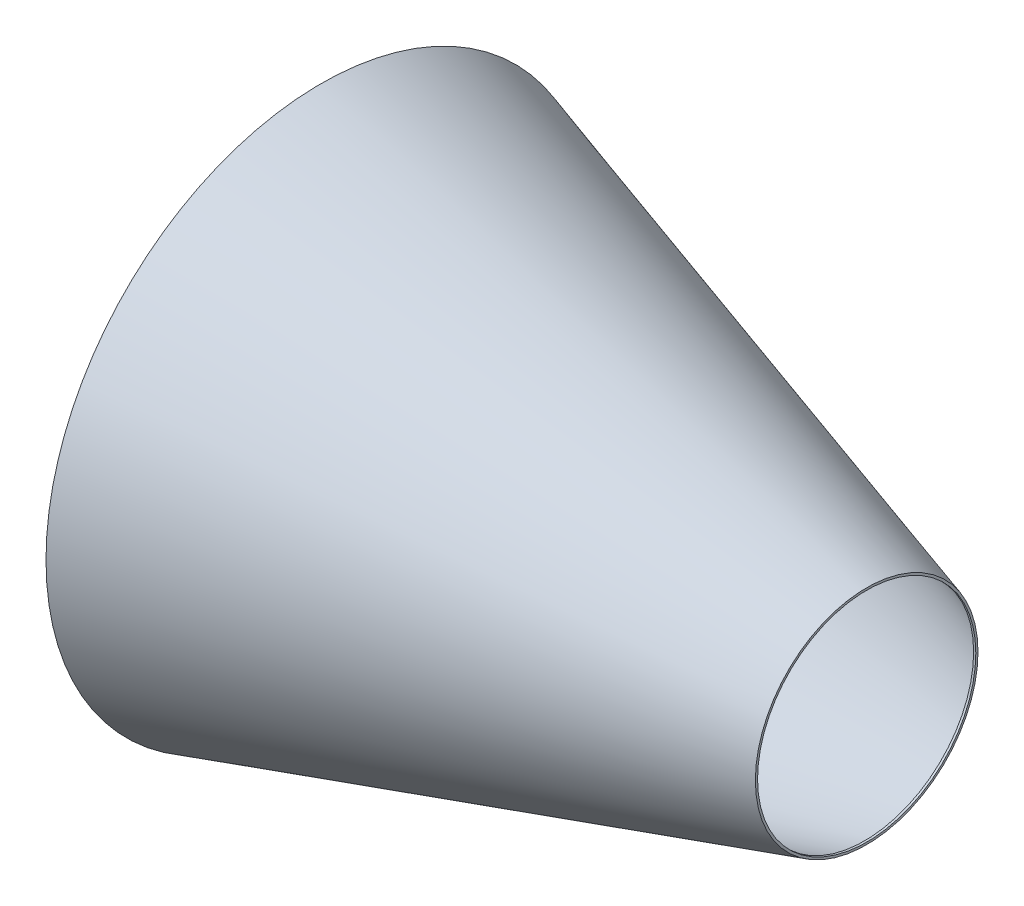
ISO-10303-21;
HEADER;
FILE_DESCRIPTION(('STEP AP214'),'2;1');
FILE_NAME('part.step','',(''),(''),'','','');
FILE_SCHEMA(('AUTOMOTIVE_DESIGN { 1 0 10303 214 1 1 1 1 }'));
ENDSEC;
DATA;
#1=APPLICATION_CONTEXT('core data for automotive mechanical design processes');
#2=APPLICATION_PROTOCOL_DEFINITION('international standard','automotive_design',2000,#1);
#3=PRODUCT_CONTEXT('',#1,'mechanical');
#4=PRODUCT('Part','Part','',(#3));
#5=PRODUCT_RELATED_PRODUCT_CATEGORY('part','',(#4));
#6=PRODUCT_DEFINITION_FORMATION('','',#4);
#7=PRODUCT_DEFINITION_CONTEXT('part definition',#1,'design');
#8=PRODUCT_DEFINITION('design','',#6,#7);
#9=PRODUCT_DEFINITION_SHAPE('','',#8);
#10=(LENGTH_UNIT() NAMED_UNIT(*) SI_UNIT(.MILLI.,.METRE.));
#11=(NAMED_UNIT(*) PLANE_ANGLE_UNIT() SI_UNIT($,.RADIAN.));
#12=(NAMED_UNIT(*) SI_UNIT($,.STERADIAN.) SOLID_ANGLE_UNIT());
#13=UNCERTAINTY_MEASURE_WITH_UNIT(LENGTH_MEASURE(1.E-05),#10,'distance_accuracy_value','');
#14=(GEOMETRIC_REPRESENTATION_CONTEXT(3) GLOBAL_UNCERTAINTY_ASSIGNED_CONTEXT((#13)) GLOBAL_UNIT_ASSIGNED_CONTEXT((#10,
#11,#12)) REPRESENTATION_CONTEXT('',''));
#15=CARTESIAN_POINT('',(0.,0.,0.));
#16=DIRECTION('',(0.,0.,1.));
#17=DIRECTION('',(1.,0.,0.));
#18=AXIS2_PLACEMENT_3D('',#15,#16,#17);
#19=CARTESIAN_POINT('',(2.,0.,0.));
#20=DIRECTION('',(-1.,0.,0.));
#21=DIRECTION('',(0.,0.,1.));
#22=AXIS2_PLACEMENT_3D('',#19,#20,#21);
#23=CONICAL_SURFACE('',#22,249.311938698218,0.291456794477867);
#24=CARTESIAN_POINT('',(498.,0.,0.));
#25=DIRECTION('',(-1.,0.,0.));
#26=DIRECTION('',(0.,0.,1.));
#27=AXIS2_PLACEMENT_3D('',#24,#25,#26);
#28=CIRCLE('',#27,100.511938698218);
#29=CARTESIAN_POINT('',(498.,0.,100.511938698218));
#30=VERTEX_POINT('',#29);
#31=EDGE_CURVE('E10',#30,#30,#28,.T.);
#32=ORIENTED_EDGE('',*,*,#31,.F.);
#33=EDGE_LOOP('',(#32));
#34=FACE_BOUND('',#33,.T.);
#35=CARTESIAN_POINT('',(2.,0.,0.));
#36=DIRECTION('',(-1.,0.,0.));
#37=DIRECTION('',(0.,0.,1.));
#38=AXIS2_PLACEMENT_3D('',#35,#36,#37);
#39=CIRCLE('',#38,249.311938698218);
#40=CARTESIAN_POINT('',(2.,0.,249.311938698218));
#41=VERTEX_POINT('',#40);
#42=EDGE_CURVE('E44',#41,#41,#39,.T.);
#43=ORIENTED_EDGE('',*,*,#42,.T.);
#44=EDGE_LOOP('',(#43));
#45=FACE_BOUND('',#44,.T.);
#46=ADVANCED_FACE('F41',(#34,#45),#23,.F.);
#47=CARTESIAN_POINT('',(498.,-2.,0.));
#48=DIRECTION('',(1.,0.,0.));
#49=DIRECTION('',(0.,0.,-1.));
#50=AXIS2_PLACEMENT_3D('',#47,#48,#49);
#51=PLANE('',#50);
#52=CARTESIAN_POINT('',(498.,0.,0.));
#53=DIRECTION('',(1.,0.,0.));
#54=DIRECTION('',(0.,0.,-1.));
#55=AXIS2_PLACEMENT_3D('',#52,#53,#54);
#56=CIRCLE('',#55,100.);
#57=CARTESIAN_POINT('',(498.,0.,-100.));
#58=VERTEX_POINT('',#57);
#59=EDGE_CURVE('E61',#58,#58,#56,.T.);
#60=ORIENTED_EDGE('',*,*,#59,.T.);
#61=EDGE_LOOP('',(#60));
#62=FACE_BOUND('',#61,.T.);
#63=ORIENTED_EDGE('',*,*,#31,.T.);
#64=EDGE_LOOP('',(#63));
#65=FACE_BOUND('',#64,.T.);
#66=ADVANCED_FACE('F70',(#62,#65),#51,.F.);
#67=CARTESIAN_POINT('',(2.,0.,0.));
#68=DIRECTION('',(-1.,0.,0.));
#69=DIRECTION('',(0.,0.,1.));
#70=AXIS2_PLACEMENT_3D('',#67,#68,#69);
#71=PLANE('',#70);
#72=ORIENTED_EDGE('',*,*,#42,.F.);
#73=EDGE_LOOP('',(#72));
#74=FACE_BOUND('',#73,.T.);
#75=CARTESIAN_POINT('',(2.,0.,0.));
#76=DIRECTION('',(-1.,0.,0.));
#77=DIRECTION('',(0.,0.,1.));
#78=AXIS2_PLACEMENT_3D('',#75,#76,#77);
#79=CIRCLE('',#78,250.);
#80=CARTESIAN_POINT('',(2.,0.,250.));
#81=VERTEX_POINT('',#80);
#82=EDGE_CURVE('E60',#81,#81,#79,.T.);
#83=ORIENTED_EDGE('',*,*,#82,.T.);
#84=EDGE_LOOP('',(#83));
#85=FACE_BOUND('',#84,.T.);
#86=ADVANCED_FACE('F104',(#74,#85),#71,.T.);
#87=CARTESIAN_POINT('',(2.,0.,0.));
#88=DIRECTION('',(-1.,0.,0.));
#89=DIRECTION('',(0.,0.,1.));
#90=AXIS2_PLACEMENT_3D('',#87,#88,#89);
#91=CYLINDRICAL_SURFACE('',#90,250.);
#92=ORIENTED_EDGE('',*,*,#82,.F.);
#93=EDGE_LOOP('',(#92));
#94=FACE_BOUND('',#93,.T.);
#95=CARTESIAN_POINT('',(0.,0.,0.));
#96=DIRECTION('',(-1.,0.,0.));
#97=DIRECTION('',(0.,0.,1.));
#98=AXIS2_PLACEMENT_3D('',#95,#96,#97);
#99=CIRCLE('',#98,250.);
#100=CARTESIAN_POINT('',(0.,0.,250.));
#101=VERTEX_POINT('',#100);
#102=EDGE_CURVE('E57',#101,#101,#99,.T.);
#103=ORIENTED_EDGE('',*,*,#102,.T.);
#104=EDGE_LOOP('',(#103));
#105=FACE_BOUND('',#104,.T.);
#106=ADVANCED_FACE('F83',(#94,#105),#91,.F.);
#107=CARTESIAN_POINT('',(500.,0.,0.));
#108=DIRECTION('',(1.,0.,0.));
#109=DIRECTION('',(0.,0.,-1.));
#110=AXIS2_PLACEMENT_3D('',#107,#108,#109);
#111=PLANE('',#110);
#112=CARTESIAN_POINT('',(500.,0.,0.));
#113=DIRECTION('',(1.,0.,0.));
#114=DIRECTION('',(0.,0.,-1.));
#115=AXIS2_PLACEMENT_3D('',#112,#113,#114);
#116=CIRCLE('',#115,100.);
#117=CARTESIAN_POINT('',(500.,0.,-100.));
#118=VERTEX_POINT('',#117);
#119=EDGE_CURVE('E64',#118,#118,#116,.T.);
#120=ORIENTED_EDGE('',*,*,#119,.F.);
#121=EDGE_LOOP('',(#120));
#122=FACE_BOUND('',#121,.T.);
#123=CARTESIAN_POINT('',(500.,0.,0.));
#124=DIRECTION('',(-1.,0.,0.));
#125=DIRECTION('',(0.,0.,1.));
#126=AXIS2_PLACEMENT_3D('',#123,#124,#125);
#127=CIRCLE('',#126,102.);
#128=CARTESIAN_POINT('',(500.,0.,102.));
#129=VERTEX_POINT('',#128);
#130=EDGE_CURVE('E48',#129,#129,#127,.T.);
#131=ORIENTED_EDGE('',*,*,#130,.F.);
#132=EDGE_LOOP('',(#131));
#133=FACE_BOUND('',#132,.T.);
#134=ADVANCED_FACE('F79',(#122,#133),#111,.T.);
#135=CARTESIAN_POINT('',(0.,0.,0.));
#136=DIRECTION('',(-1.,0.,0.));
#137=DIRECTION('',(0.,0.,1.));
#138=AXIS2_PLACEMENT_3D('',#135,#136,#137);
#139=CONICAL_SURFACE('',#138,252.,0.291456794477867);
#140=ORIENTED_EDGE('',*,*,#130,.T.);
#141=EDGE_LOOP('',(#140));
#142=FACE_BOUND('',#141,.T.);
#143=CARTESIAN_POINT('',(0.,0.,0.));
#144=DIRECTION('',(-1.,0.,0.));
#145=DIRECTION('',(0.,0.,1.));
#146=AXIS2_PLACEMENT_3D('',#143,#144,#145);
#147=CIRCLE('',#146,252.);
#148=CARTESIAN_POINT('',(0.,0.,252.));
#149=VERTEX_POINT('',#148);
#150=EDGE_CURVE('E52',#149,#149,#147,.T.);
#151=ORIENTED_EDGE('',*,*,#150,.F.);
#152=EDGE_LOOP('',(#151));
#153=FACE_BOUND('',#152,.T.);
#154=ADVANCED_FACE('F82',(#142,#153),#139,.T.);
#155=CARTESIAN_POINT('',(0.,0.,0.));
#156=DIRECTION('',(-1.,0.,0.));
#157=DIRECTION('',(0.,0.,1.));
#158=AXIS2_PLACEMENT_3D('',#155,#156,#157);
#159=PLANE('',#158);
#160=ORIENTED_EDGE('',*,*,#102,.F.);
#161=EDGE_LOOP('',(#160));
#162=FACE_BOUND('',#161,.T.);
#163=ORIENTED_EDGE('',*,*,#150,.T.);
#164=EDGE_LOOP('',(#163));
#165=FACE_BOUND('',#164,.T.);
#166=ADVANCED_FACE('F75',(#162,#165),#159,.T.);
#167=CARTESIAN_POINT('',(498.,0.,0.));
#168=DIRECTION('',(1.,0.,0.));
#169=DIRECTION('',(0.,0.,-1.));
#170=AXIS2_PLACEMENT_3D('',#167,#168,#169);
#171=CYLINDRICAL_SURFACE('',#170,100.);
#172=ORIENTED_EDGE('',*,*,#59,.F.);
#173=EDGE_LOOP('',(#172));
#174=FACE_BOUND('',#173,.T.);
#175=ORIENTED_EDGE('',*,*,#119,.T.);
#176=EDGE_LOOP('',(#175));
#177=FACE_BOUND('',#176,.T.);
#178=ADVANCED_FACE('F72',(#174,#177),#171,.F.);
#179=CLOSED_SHELL('',(#46,#66,#86,#106,#134,#154,#166,#178));
#180=MANIFOLD_SOLID_BREP('B2',#179);
#181=ADVANCED_BREP_SHAPE_REPRESENTATION('',(#18,#180),#14);
#182=SHAPE_DEFINITION_REPRESENTATION(#9,#181);
ENDSEC;
END-ISO-10303-21;
